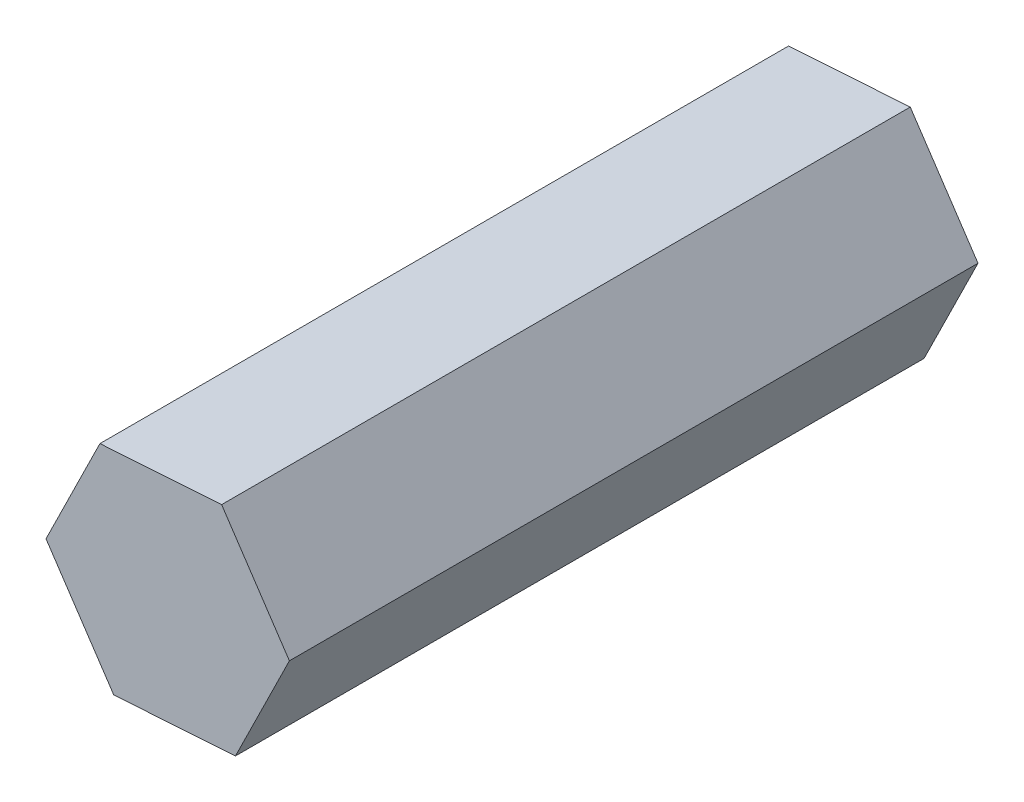
ISO-10303-21;
HEADER;
FILE_DESCRIPTION(('STEP AP214'),'2;1');
FILE_NAME('part.step','',(''),(''),'','','');
FILE_SCHEMA(('AUTOMOTIVE_DESIGN { 1 0 10303 214 1 1 1 1 }'));
ENDSEC;
DATA;
#1=APPLICATION_CONTEXT('core data for automotive mechanical design processes');
#2=APPLICATION_PROTOCOL_DEFINITION('international standard','automotive_design',2000,#1);
#3=PRODUCT_CONTEXT('',#1,'mechanical');
#4=PRODUCT('Part','Part','',(#3));
#5=PRODUCT_RELATED_PRODUCT_CATEGORY('part','',(#4));
#6=PRODUCT_DEFINITION_FORMATION('','',#4);
#7=PRODUCT_DEFINITION_CONTEXT('part definition',#1,'design');
#8=PRODUCT_DEFINITION('design','',#6,#7);
#9=PRODUCT_DEFINITION_SHAPE('','',#8);
#10=(LENGTH_UNIT() NAMED_UNIT(*) SI_UNIT(.MILLI.,.METRE.));
#11=(NAMED_UNIT(*) PLANE_ANGLE_UNIT() SI_UNIT($,.RADIAN.));
#12=(NAMED_UNIT(*) SI_UNIT($,.STERADIAN.) SOLID_ANGLE_UNIT());
#13=UNCERTAINTY_MEASURE_WITH_UNIT(LENGTH_MEASURE(1.E-05),#10,'distance_accuracy_value','');
#14=(GEOMETRIC_REPRESENTATION_CONTEXT(3) GLOBAL_UNCERTAINTY_ASSIGNED_CONTEXT((#13)) GLOBAL_UNIT_ASSIGNED_CONTEXT((#10,
#11,#12)) REPRESENTATION_CONTEXT('',''));
#15=CARTESIAN_POINT('',(0.,0.,0.));
#16=DIRECTION('',(0.,0.,1.));
#17=DIRECTION('',(1.,0.,0.));
#18=AXIS2_PLACEMENT_3D('',#15,#16,#17);
#19=CARTESIAN_POINT('',(7.31660213341362,0.480277580843075,41.402));
#20=DIRECTION('',(-0.831415008995449,-0.555651943951515,0.));
#21=DIRECTION('',(0.555651943951515,-0.831415008995449,0.));
#22=AXIS2_PLACEMENT_3D('',#19,#20,#21);
#23=PLANE('',#22);
#24=DIRECTION('',(-0.555651943951515,0.831415008995449,0.));
#25=VECTOR('',#24,1.);
#26=CARTESIAN_POINT('',(7.31660213341362,0.480277580843075,0.));
#27=LINE('',#26,#25);
#28=CARTESIAN_POINT('',(7.31660213341362,0.480277580843075,0.));
#29=VERTEX_POINT('',#28);
#30=CARTESIAN_POINT('',(3.24236848082857,6.57650210734116,0.));
#31=VERTEX_POINT('',#30);
#32=EDGE_CURVE('E117',#29,#31,#27,.T.);
#33=ORIENTED_EDGE('',*,*,#32,.T.);
#34=DIRECTION('',(0.,0.,-1.));
#35=VECTOR('',#34,1.);
#36=CARTESIAN_POINT('',(3.24236848082857,6.57650210734116,41.402));
#37=LINE('',#36,#35);
#38=CARTESIAN_POINT('',(3.24236848082857,6.57650210734116,41.402));
#39=VERTEX_POINT('',#38);
#40=EDGE_CURVE('E11',#39,#31,#37,.T.);
#41=ORIENTED_EDGE('',*,*,#40,.F.);
#42=DIRECTION('',(-0.555651943951515,0.831415008995449,0.));
#43=VECTOR('',#42,1.);
#44=CARTESIAN_POINT('',(7.31660213341362,0.480277580843075,41.402));
#45=LINE('',#44,#43);
#46=CARTESIAN_POINT('',(7.31660213341362,0.480277580843075,41.402));
#47=VERTEX_POINT('',#46);
#48=EDGE_CURVE('E127',#47,#39,#45,.T.);
#49=ORIENTED_EDGE('',*,*,#48,.F.);
#50=DIRECTION('',(0.,0.,-1.));
#51=VECTOR('',#50,1.);
#52=CARTESIAN_POINT('',(7.31660213341362,0.480277580843075,41.402));
#53=LINE('',#52,#51);
#54=EDGE_CURVE('E113',#47,#29,#53,.T.);
#55=ORIENTED_EDGE('',*,*,#54,.T.);
#56=EDGE_LOOP('',(#33,#41,#49,#55));
#57=FACE_BOUND('',#56,.T.);
#58=ADVANCED_FACE('F33',(#57),#23,.F.);
#59=CARTESIAN_POINT('',(3.24236848082857,6.57650210734116,41.402));
#60=DIRECTION('',(0.0655011946264941,-0.997852490853484,0.));
#61=DIRECTION('',(0.997852490853484,0.0655011946264941,0.));
#62=AXIS2_PLACEMENT_3D('',#59,#60,#61);
#63=PLANE('',#62);
#64=DIRECTION('',(-0.997852490853484,-0.0655011946264941,0.));
#65=VECTOR('',#64,1.);
#66=CARTESIAN_POINT('',(3.24236848082857,6.57650210734116,0.));
#67=LINE('',#66,#65);
#68=CARTESIAN_POINT('',(-4.07423365258505,6.09622452649808,0.));
#69=VERTEX_POINT('',#68);
#70=EDGE_CURVE('E120',#31,#69,#67,.T.);
#71=ORIENTED_EDGE('',*,*,#70,.T.);
#72=DIRECTION('',(0.,0.,-1.));
#73=VECTOR('',#72,1.);
#74=CARTESIAN_POINT('',(-4.07423365258505,6.09622452649808,41.402));
#75=LINE('',#74,#73);
#76=CARTESIAN_POINT('',(-4.07423365258505,6.09622452649808,41.402));
#77=VERTEX_POINT('',#76);
#78=EDGE_CURVE('E41',#77,#69,#75,.T.);
#79=ORIENTED_EDGE('',*,*,#78,.F.);
#80=DIRECTION('',(-0.997852490853484,-0.0655011946264941,0.));
#81=VECTOR('',#80,1.);
#82=CARTESIAN_POINT('',(3.24236848082857,6.57650210734116,41.402));
#83=LINE('',#82,#81);
#84=EDGE_CURVE('E86',#39,#77,#83,.T.);
#85=ORIENTED_EDGE('',*,*,#84,.F.);
#86=ORIENTED_EDGE('',*,*,#40,.T.);
#87=EDGE_LOOP('',(#71,#79,#85,#86));
#88=FACE_BOUND('',#87,.T.);
#89=ADVANCED_FACE('F151',(#88),#63,.F.);
#90=CARTESIAN_POINT('',(-4.07423365258505,6.09622452649808,41.402));
#91=DIRECTION('',(0.896916203621943,-0.442200546901969,0.));
#92=DIRECTION('',(0.442200546901969,0.896916203621943,0.));
#93=AXIS2_PLACEMENT_3D('',#90,#91,#92);
#94=PLANE('',#93);
#95=DIRECTION('',(-0.442200546901969,-0.896916203621943,0.));
#96=VECTOR('',#95,1.);
#97=CARTESIAN_POINT('',(-4.07423365258505,6.09622452649808,0.));
#98=LINE('',#97,#96);
#99=CARTESIAN_POINT('',(-7.31660213341362,-0.480277580843077,0.));
#100=VERTEX_POINT('',#99);
#101=EDGE_CURVE('E122',#69,#100,#98,.T.);
#102=ORIENTED_EDGE('',*,*,#101,.T.);
#103=DIRECTION('',(0.,0.,-1.));
#104=VECTOR('',#103,1.);
#105=CARTESIAN_POINT('',(-7.31660213341362,-0.480277580843077,41.402));
#106=LINE('',#105,#104);
#107=CARTESIAN_POINT('',(-7.31660213341362,-0.480277580843077,41.402));
#108=VERTEX_POINT('',#107);
#109=EDGE_CURVE('E108',#108,#100,#106,.T.);
#110=ORIENTED_EDGE('',*,*,#109,.F.);
#111=DIRECTION('',(-0.442200546901969,-0.896916203621943,0.));
#112=VECTOR('',#111,1.);
#113=CARTESIAN_POINT('',(-4.07423365258505,6.09622452649808,41.402));
#114=LINE('',#113,#112);
#115=EDGE_CURVE('E99',#77,#108,#114,.T.);
#116=ORIENTED_EDGE('',*,*,#115,.F.);
#117=ORIENTED_EDGE('',*,*,#78,.T.);
#118=EDGE_LOOP('',(#102,#110,#116,#117));
#119=FACE_BOUND('',#118,.T.);
#120=ADVANCED_FACE('F133',(#119),#94,.F.);
#121=CARTESIAN_POINT('',(-7.31660213341362,-0.480277580843077,41.402));
#122=DIRECTION('',(0.831415008995449,0.555651943951515,0.));
#123=DIRECTION('',(-0.555651943951515,0.831415008995449,0.));
#124=AXIS2_PLACEMENT_3D('',#121,#122,#123);
#125=PLANE('',#124);
#126=DIRECTION('',(0.555651943951515,-0.831415008995449,0.));
#127=VECTOR('',#126,1.);
#128=CARTESIAN_POINT('',(-7.31660213341362,-0.480277580843077,0.));
#129=LINE('',#128,#127);
#130=CARTESIAN_POINT('',(-3.24236848082857,-6.57650210734116,0.));
#131=VERTEX_POINT('',#130);
#132=EDGE_CURVE('E107',#100,#131,#129,.T.);
#133=ORIENTED_EDGE('',*,*,#132,.T.);
#134=DIRECTION('',(0.,0.,-1.));
#135=VECTOR('',#134,1.);
#136=CARTESIAN_POINT('',(-3.24236848082857,-6.57650210734116,41.402));
#137=LINE('',#136,#135);
#138=CARTESIAN_POINT('',(-3.24236848082857,-6.57650210734116,41.402));
#139=VERTEX_POINT('',#138);
#140=EDGE_CURVE('E104',#139,#131,#137,.T.);
#141=ORIENTED_EDGE('',*,*,#140,.F.);
#142=DIRECTION('',(0.555651943951515,-0.831415008995449,0.));
#143=VECTOR('',#142,1.);
#144=CARTESIAN_POINT('',(-7.31660213341362,-0.480277580843077,41.402));
#145=LINE('',#144,#143);
#146=EDGE_CURVE('E93',#108,#139,#145,.T.);
#147=ORIENTED_EDGE('',*,*,#146,.F.);
#148=ORIENTED_EDGE('',*,*,#109,.T.);
#149=EDGE_LOOP('',(#133,#141,#147,#148));
#150=FACE_BOUND('',#149,.T.);
#151=ADVANCED_FACE('F105',(#150),#125,.F.);
#152=CARTESIAN_POINT('',(-3.24236848082857,-6.57650210734116,41.402));
#153=DIRECTION('',(-0.0655011946264938,0.997852490853484,0.));
#154=DIRECTION('',(-0.997852490853484,-0.0655011946264938,0.));
#155=AXIS2_PLACEMENT_3D('',#152,#153,#154);
#156=PLANE('',#155);
#157=DIRECTION('',(0.997852490853484,0.0655011946264938,0.));
#158=VECTOR('',#157,1.);
#159=CARTESIAN_POINT('',(-3.24236848082857,-6.57650210734116,0.));
#160=LINE('',#159,#158);
#161=CARTESIAN_POINT('',(4.07423365258504,-6.09622452649809,0.));
#162=VERTEX_POINT('',#161);
#163=EDGE_CURVE('E72',#131,#162,#160,.T.);
#164=ORIENTED_EDGE('',*,*,#163,.T.);
#165=DIRECTION('',(0.,0.,-1.));
#166=VECTOR('',#165,1.);
#167=CARTESIAN_POINT('',(4.07423365258504,-6.09622452649809,41.402));
#168=LINE('',#167,#166);
#169=CARTESIAN_POINT('',(4.07423365258504,-6.09622452649809,41.402));
#170=VERTEX_POINT('',#169);
#171=EDGE_CURVE('E109',#170,#162,#168,.T.);
#172=ORIENTED_EDGE('',*,*,#171,.F.);
#173=DIRECTION('',(0.997852490853484,0.0655011946264938,0.));
#174=VECTOR('',#173,1.);
#175=CARTESIAN_POINT('',(-3.24236848082857,-6.57650210734116,41.402));
#176=LINE('',#175,#174);
#177=EDGE_CURVE('E97',#139,#170,#176,.T.);
#178=ORIENTED_EDGE('',*,*,#177,.F.);
#179=ORIENTED_EDGE('',*,*,#140,.T.);
#180=EDGE_LOOP('',(#164,#172,#178,#179));
#181=FACE_BOUND('',#180,.T.);
#182=ADVANCED_FACE('F111',(#181),#156,.F.);
#183=CARTESIAN_POINT('',(4.07423365258504,-6.09622452649809,41.402));
#184=DIRECTION('',(-0.896916203621943,0.44220054690197,0.));
#185=DIRECTION('',(-0.44220054690197,-0.896916203621943,0.));
#186=AXIS2_PLACEMENT_3D('',#183,#184,#185);
#187=PLANE('',#186);
#188=DIRECTION('',(0.44220054690197,0.896916203621943,0.));
#189=VECTOR('',#188,1.);
#190=CARTESIAN_POINT('',(4.07423365258504,-6.09622452649809,0.));
#191=LINE('',#190,#189);
#192=EDGE_CURVE('E78',#162,#29,#191,.T.);
#193=ORIENTED_EDGE('',*,*,#192,.T.);
#194=ORIENTED_EDGE('',*,*,#54,.F.);
#195=DIRECTION('',(0.44220054690197,0.896916203621943,0.));
#196=VECTOR('',#195,1.);
#197=CARTESIAN_POINT('',(4.07423365258504,-6.09622452649809,41.402));
#198=LINE('',#197,#196);
#199=EDGE_CURVE('E49',#170,#47,#198,.T.);
#200=ORIENTED_EDGE('',*,*,#199,.F.);
#201=ORIENTED_EDGE('',*,*,#171,.T.);
#202=EDGE_LOOP('',(#193,#194,#200,#201));
#203=FACE_BOUND('',#202,.T.);
#204=ADVANCED_FACE('F140',(#203),#187,.F.);
#205=CARTESIAN_POINT('',(0.,0.,41.402));
#206=DIRECTION('',(0.,0.,1.));
#207=DIRECTION('',(1.,0.,0.));
#208=AXIS2_PLACEMENT_3D('',#205,#206,#207);
#209=PLANE('',#208);
#210=ORIENTED_EDGE('',*,*,#48,.T.);
#211=ORIENTED_EDGE('',*,*,#84,.T.);
#212=ORIENTED_EDGE('',*,*,#115,.T.);
#213=ORIENTED_EDGE('',*,*,#146,.T.);
#214=ORIENTED_EDGE('',*,*,#177,.T.);
#215=ORIENTED_EDGE('',*,*,#199,.T.);
#216=EDGE_LOOP('',(#210,#211,#212,#213,#214,#215));
#217=FACE_BOUND('',#216,.T.);
#218=ADVANCED_FACE('F95',(#217),#209,.T.);
#219=CARTESIAN_POINT('',(0.,0.,0.));
#220=DIRECTION('',(0.,0.,1.));
#221=DIRECTION('',(1.,0.,0.));
#222=AXIS2_PLACEMENT_3D('',#219,#220,#221);
#223=PLANE('',#222);
#224=ORIENTED_EDGE('',*,*,#32,.F.);
#225=ORIENTED_EDGE('',*,*,#192,.F.);
#226=ORIENTED_EDGE('',*,*,#163,.F.);
#227=ORIENTED_EDGE('',*,*,#132,.F.);
#228=ORIENTED_EDGE('',*,*,#101,.F.);
#229=ORIENTED_EDGE('',*,*,#70,.F.);
#230=EDGE_LOOP('',(#224,#225,#226,#227,#228,#229));
#231=FACE_BOUND('',#230,.T.);
#232=ADVANCED_FACE('F136',(#231),#223,.F.);
#233=CLOSED_SHELL('',(#58,#89,#120,#151,#182,#204,#218,#232));
#234=MANIFOLD_SOLID_BREP('B2',#233);
#235=ADVANCED_BREP_SHAPE_REPRESENTATION('',(#18,#234),#14);
#236=SHAPE_DEFINITION_REPRESENTATION(#9,#235);
ENDSEC;
END-ISO-10303-21;
